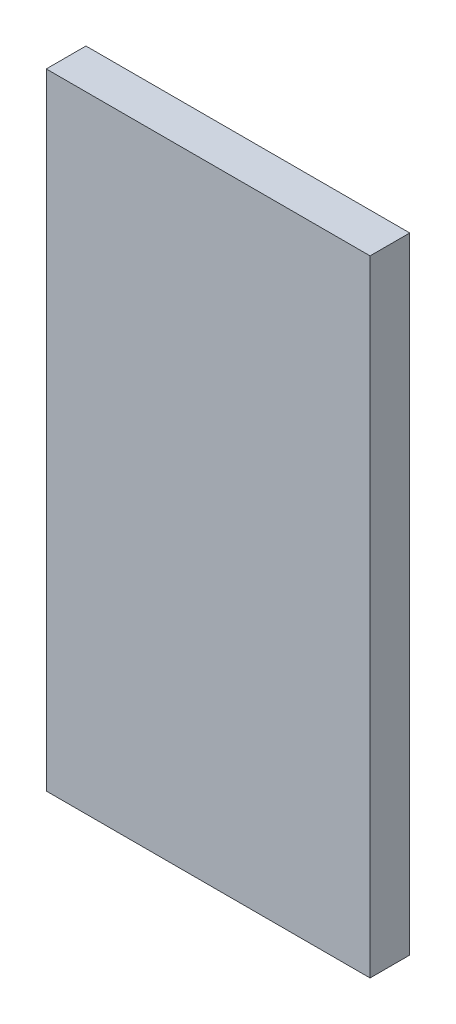
ISO-10303-21;
HEADER;
FILE_DESCRIPTION(('STEP AP214'),'2;1');
FILE_NAME('part.step','',(''),(''),'','','');
FILE_SCHEMA(('AUTOMOTIVE_DESIGN { 1 0 10303 214 1 1 1 1 }'));
ENDSEC;
DATA;
#1=APPLICATION_CONTEXT('core data for automotive mechanical design processes');
#2=APPLICATION_PROTOCOL_DEFINITION('international standard','automotive_design',2000,#1);
#3=PRODUCT_CONTEXT('',#1,'mechanical');
#4=PRODUCT('Part','Part','',(#3));
#5=PRODUCT_RELATED_PRODUCT_CATEGORY('part','',(#4));
#6=PRODUCT_DEFINITION_FORMATION('','',#4);
#7=PRODUCT_DEFINITION_CONTEXT('part definition',#1,'design');
#8=PRODUCT_DEFINITION('design','',#6,#7);
#9=PRODUCT_DEFINITION_SHAPE('','',#8);
#10=(LENGTH_UNIT() NAMED_UNIT(*) SI_UNIT(.MILLI.,.METRE.));
#11=(NAMED_UNIT(*) PLANE_ANGLE_UNIT() SI_UNIT($,.RADIAN.));
#12=(NAMED_UNIT(*) SI_UNIT($,.STERADIAN.) SOLID_ANGLE_UNIT());
#13=UNCERTAINTY_MEASURE_WITH_UNIT(LENGTH_MEASURE(1.E-05),#10,'distance_accuracy_value','');
#14=(GEOMETRIC_REPRESENTATION_CONTEXT(3) GLOBAL_UNCERTAINTY_ASSIGNED_CONTEXT((#13)) GLOBAL_UNIT_ASSIGNED_CONTEXT((#10,
#11,#12)) REPRESENTATION_CONTEXT('',''));
#15=CARTESIAN_POINT('',(0.,0.,0.));
#16=DIRECTION('',(0.,0.,1.));
#17=DIRECTION('',(1.,0.,0.));
#18=AXIS2_PLACEMENT_3D('',#15,#16,#17);
#19=CARTESIAN_POINT('',(9.752,-3.698,0.1));
#20=DIRECTION('',(0.,0.,1.));
#21=DIRECTION('',(1.,0.,0.));
#22=AXIS2_PLACEMENT_3D('',#19,#20,#21);
#23=PLANE('',#22);
#24=DIRECTION('',(0.,1.,0.));
#25=VECTOR('',#24,1.);
#26=CARTESIAN_POINT('',(10.568,-3.698,0.1));
#27=LINE('',#26,#25);
#28=CARTESIAN_POINT('',(10.568,-2.122,0.1));
#29=VERTEX_POINT('',#28);
#30=CARTESIAN_POINT('',(10.568,-3.698,0.1));
#31=VERTEX_POINT('',#30);
#32=EDGE_CURVE('E75',#29,#31,#27,.F.);
#33=ORIENTED_EDGE('',*,*,#32,.F.);
#34=DIRECTION('',(1.,0.,0.));
#35=VECTOR('',#34,1.);
#36=CARTESIAN_POINT('',(9.752,-2.122,0.1));
#37=LINE('',#36,#35);
#38=CARTESIAN_POINT('',(9.752,-2.122,0.1));
#39=VERTEX_POINT('',#38);
#40=EDGE_CURVE('E57',#39,#29,#37,.T.);
#41=ORIENTED_EDGE('',*,*,#40,.F.);
#42=DIRECTION('',(0.,1.,0.));
#43=VECTOR('',#42,1.);
#44=CARTESIAN_POINT('',(9.752,-3.698,0.1));
#45=LINE('',#44,#43);
#46=CARTESIAN_POINT('',(9.752,-3.698,0.1));
#47=VERTEX_POINT('',#46);
#48=EDGE_CURVE('E19',#39,#47,#45,.F.);
#49=ORIENTED_EDGE('',*,*,#48,.T.);
#50=DIRECTION('',(1.,0.,0.));
#51=VECTOR('',#50,1.);
#52=CARTESIAN_POINT('',(9.752,-3.698,0.1));
#53=LINE('',#52,#51);
#54=EDGE_CURVE('E54',#47,#31,#53,.T.);
#55=ORIENTED_EDGE('',*,*,#54,.T.);
#56=EDGE_LOOP('',(#33,#41,#49,#55));
#57=FACE_BOUND('',#56,.T.);
#58=ADVANCED_FACE('F16',(#57),#23,.T.);
#59=CARTESIAN_POINT('',(9.752,-3.698,0.));
#60=DIRECTION('',(1.,0.,0.));
#61=DIRECTION('',(0.,0.,-1.));
#62=AXIS2_PLACEMENT_3D('',#59,#60,#61);
#63=PLANE('',#62);
#64=DIRECTION('',(0.,0.,1.));
#65=VECTOR('',#64,1.);
#66=CARTESIAN_POINT('',(9.752,-2.122,0.));
#67=LINE('',#66,#65);
#68=CARTESIAN_POINT('',(9.752,-2.122,0.));
#69=VERTEX_POINT('',#68);
#70=EDGE_CURVE('E77',#69,#39,#67,.T.);
#71=ORIENTED_EDGE('',*,*,#70,.F.);
#72=DIRECTION('',(0.,1.,0.));
#73=VECTOR('',#72,1.);
#74=CARTESIAN_POINT('',(9.752,-3.698,0.));
#75=LINE('',#74,#73);
#76=CARTESIAN_POINT('',(9.752,-3.698,0.));
#77=VERTEX_POINT('',#76);
#78=EDGE_CURVE('E72',#69,#77,#75,.F.);
#79=ORIENTED_EDGE('',*,*,#78,.T.);
#80=DIRECTION('',(0.,0.,1.));
#81=VECTOR('',#80,1.);
#82=CARTESIAN_POINT('',(9.752,-3.698,0.));
#83=LINE('',#82,#81);
#84=EDGE_CURVE('E62',#77,#47,#83,.T.);
#85=ORIENTED_EDGE('',*,*,#84,.T.);
#86=ORIENTED_EDGE('',*,*,#48,.F.);
#87=EDGE_LOOP('',(#71,#79,#85,#86));
#88=FACE_BOUND('',#87,.T.);
#89=ADVANCED_FACE('F71',(#88),#63,.F.);
#90=CARTESIAN_POINT('',(9.752,-3.698,0.));
#91=DIRECTION('',(0.,1.,0.));
#92=DIRECTION('',(0.,0.,1.));
#93=AXIS2_PLACEMENT_3D('',#90,#91,#92);
#94=PLANE('',#93);
#95=ORIENTED_EDGE('',*,*,#54,.F.);
#96=ORIENTED_EDGE('',*,*,#84,.F.);
#97=DIRECTION('',(1.,0.,0.));
#98=VECTOR('',#97,1.);
#99=CARTESIAN_POINT('',(9.752,-3.698,0.));
#100=LINE('',#99,#98);
#101=CARTESIAN_POINT('',(10.568,-3.698,0.));
#102=VERTEX_POINT('',#101);
#103=EDGE_CURVE('E82',#77,#102,#100,.T.);
#104=ORIENTED_EDGE('',*,*,#103,.T.);
#105=DIRECTION('',(0.,0.,-1.));
#106=VECTOR('',#105,1.);
#107=CARTESIAN_POINT('',(10.568,-3.698,0.));
#108=LINE('',#107,#106);
#109=EDGE_CURVE('E68',#31,#102,#108,.T.);
#110=ORIENTED_EDGE('',*,*,#109,.F.);
#111=EDGE_LOOP('',(#95,#96,#104,#110));
#112=FACE_BOUND('',#111,.T.);
#113=ADVANCED_FACE('F65',(#112),#94,.F.);
#114=CARTESIAN_POINT('',(10.568,-3.698,0.));
#115=DIRECTION('',(1.,0.,0.));
#116=DIRECTION('',(0.,0.,-1.));
#117=AXIS2_PLACEMENT_3D('',#114,#115,#116);
#118=PLANE('',#117);
#119=DIRECTION('',(0.,0.,1.));
#120=VECTOR('',#119,1.);
#121=CARTESIAN_POINT('',(10.568,-2.122,0.));
#122=LINE('',#121,#120);
#123=CARTESIAN_POINT('',(10.568,-2.122,0.));
#124=VERTEX_POINT('',#123);
#125=EDGE_CURVE('E33',#29,#124,#122,.F.);
#126=ORIENTED_EDGE('',*,*,#125,.F.);
#127=ORIENTED_EDGE('',*,*,#32,.T.);
#128=ORIENTED_EDGE('',*,*,#109,.T.);
#129=DIRECTION('',(0.,1.,0.));
#130=VECTOR('',#129,1.);
#131=CARTESIAN_POINT('',(10.568,-3.698,0.));
#132=LINE('',#131,#130);
#133=EDGE_CURVE('E25',#102,#124,#132,.T.);
#134=ORIENTED_EDGE('',*,*,#133,.T.);
#135=EDGE_LOOP('',(#126,#127,#128,#134));
#136=FACE_BOUND('',#135,.T.);
#137=ADVANCED_FACE('F87',(#136),#118,.T.);
#138=CARTESIAN_POINT('',(9.752,-2.122,0.));
#139=DIRECTION('',(0.,1.,0.));
#140=DIRECTION('',(0.,0.,1.));
#141=AXIS2_PLACEMENT_3D('',#138,#139,#140);
#142=PLANE('',#141);
#143=ORIENTED_EDGE('',*,*,#40,.T.);
#144=ORIENTED_EDGE('',*,*,#125,.T.);
#145=DIRECTION('',(1.,0.,0.));
#146=VECTOR('',#145,1.);
#147=CARTESIAN_POINT('',(9.752,-2.122,0.));
#148=LINE('',#147,#146);
#149=EDGE_CURVE('E11',#124,#69,#148,.F.);
#150=ORIENTED_EDGE('',*,*,#149,.T.);
#151=ORIENTED_EDGE('',*,*,#70,.T.);
#152=EDGE_LOOP('',(#143,#144,#150,#151));
#153=FACE_BOUND('',#152,.T.);
#154=ADVANCED_FACE('F90',(#153),#142,.T.);
#155=CARTESIAN_POINT('',(9.752,-3.698,0.));
#156=DIRECTION('',(0.,0.,1.));
#157=DIRECTION('',(1.,0.,0.));
#158=AXIS2_PLACEMENT_3D('',#155,#156,#157);
#159=PLANE('',#158);
#160=ORIENTED_EDGE('',*,*,#133,.F.);
#161=ORIENTED_EDGE('',*,*,#103,.F.);
#162=ORIENTED_EDGE('',*,*,#78,.F.);
#163=ORIENTED_EDGE('',*,*,#149,.F.);
#164=EDGE_LOOP('',(#160,#161,#162,#163));
#165=FACE_BOUND('',#164,.T.);
#166=ADVANCED_FACE('F89',(#165),#159,.F.);
#167=CLOSED_SHELL('',(#58,#89,#113,#137,#154,#166));
#168=MANIFOLD_SOLID_BREP('B1',#167);
#169=ADVANCED_BREP_SHAPE_REPRESENTATION('',(#18,#168),#14);
#170=SHAPE_DEFINITION_REPRESENTATION(#9,#169);
ENDSEC;
END-ISO-10303-21;
